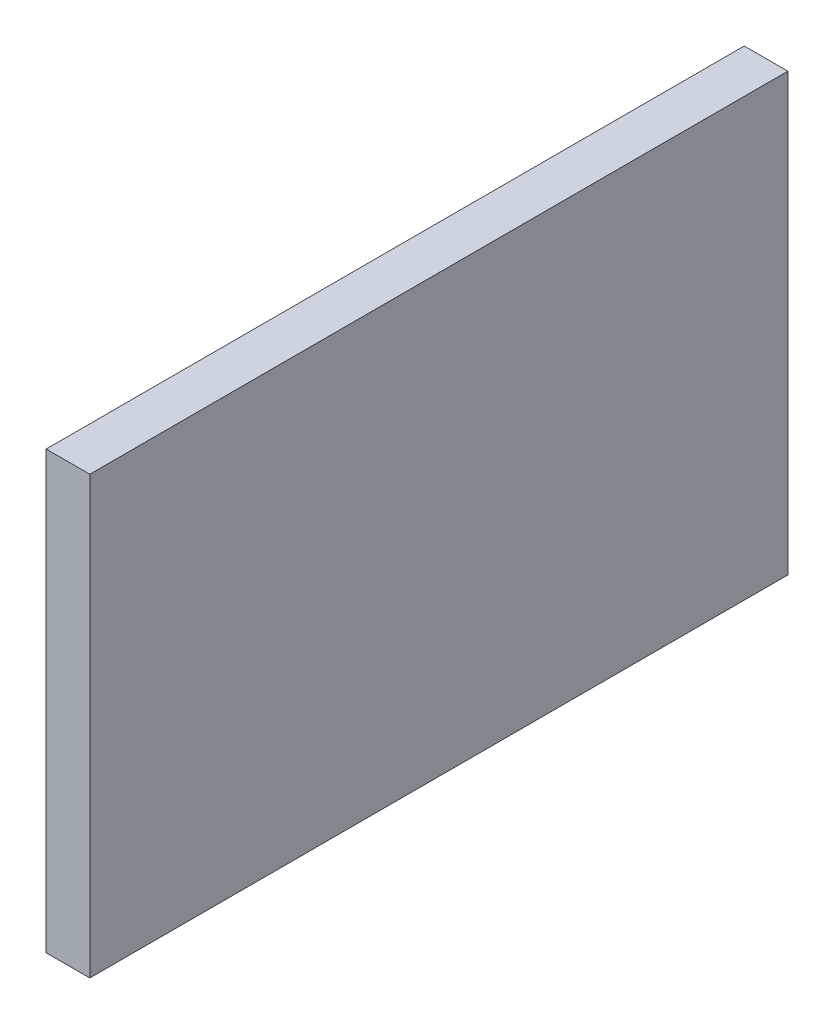
ISO-10303-21;
HEADER;
FILE_DESCRIPTION(('STEP AP214'),'2;1');
FILE_NAME('part.step','',(''),(''),'','','');
FILE_SCHEMA(('AUTOMOTIVE_DESIGN { 1 0 10303 214 1 1 1 1 }'));
ENDSEC;
DATA;
#1=APPLICATION_CONTEXT('core data for automotive mechanical design processes');
#2=APPLICATION_PROTOCOL_DEFINITION('international standard','automotive_design',2000,#1);
#3=PRODUCT_CONTEXT('',#1,'mechanical');
#4=PRODUCT('Part','Part','',(#3));
#5=PRODUCT_RELATED_PRODUCT_CATEGORY('part','',(#4));
#6=PRODUCT_DEFINITION_FORMATION('','',#4);
#7=PRODUCT_DEFINITION_CONTEXT('part definition',#1,'design');
#8=PRODUCT_DEFINITION('design','',#6,#7);
#9=PRODUCT_DEFINITION_SHAPE('','',#8);
#10=(LENGTH_UNIT() NAMED_UNIT(*) SI_UNIT(.MILLI.,.METRE.));
#11=(NAMED_UNIT(*) PLANE_ANGLE_UNIT() SI_UNIT($,.RADIAN.));
#12=(NAMED_UNIT(*) SI_UNIT($,.STERADIAN.) SOLID_ANGLE_UNIT());
#13=UNCERTAINTY_MEASURE_WITH_UNIT(LENGTH_MEASURE(1.E-05),#10,'distance_accuracy_value','');
#14=(GEOMETRIC_REPRESENTATION_CONTEXT(3) GLOBAL_UNCERTAINTY_ASSIGNED_CONTEXT((#13)) GLOBAL_UNIT_ASSIGNED_CONTEXT((#10,
#11,#12)) REPRESENTATION_CONTEXT('',''));
#15=CARTESIAN_POINT('',(0.,0.,0.));
#16=DIRECTION('',(0.,0.,1.));
#17=DIRECTION('',(1.,0.,0.));
#18=AXIS2_PLACEMENT_3D('',#15,#16,#17);
#19=CARTESIAN_POINT('',(3.175,-15.875,-25.4));
#20=DIRECTION('',(0.,0.,1.));
#21=DIRECTION('',(1.,0.,0.));
#22=AXIS2_PLACEMENT_3D('',#19,#20,#21);
#23=PLANE('',#22);
#24=DIRECTION('',(0.,1.,0.));
#25=VECTOR('',#24,1.);
#26=CARTESIAN_POINT('',(0.,-15.875,-25.4));
#27=LINE('',#26,#25);
#28=CARTESIAN_POINT('',(0.,-15.875,-25.4));
#29=VERTEX_POINT('',#28);
#30=CARTESIAN_POINT('',(0.,15.875,-25.4));
#31=VERTEX_POINT('',#30);
#32=EDGE_CURVE('E96',#29,#31,#27,.T.);
#33=ORIENTED_EDGE('',*,*,#32,.T.);
#34=DIRECTION('',(-1.,0.,0.));
#35=VECTOR('',#34,1.);
#36=CARTESIAN_POINT('',(3.175,15.875,-25.4));
#37=LINE('',#36,#35);
#38=CARTESIAN_POINT('',(3.175,15.875,-25.4));
#39=VERTEX_POINT('',#38);
#40=EDGE_CURVE('E11',#39,#31,#37,.T.);
#41=ORIENTED_EDGE('',*,*,#40,.F.);
#42=DIRECTION('',(0.,1.,0.));
#43=VECTOR('',#42,1.);
#44=CARTESIAN_POINT('',(3.175,-15.875,-25.4));
#45=LINE('',#44,#43);
#46=CARTESIAN_POINT('',(3.175,-15.875,-25.4));
#47=VERTEX_POINT('',#46);
#48=EDGE_CURVE('E84',#47,#39,#45,.T.);
#49=ORIENTED_EDGE('',*,*,#48,.F.);
#50=DIRECTION('',(-1.,0.,0.));
#51=VECTOR('',#50,1.);
#52=CARTESIAN_POINT('',(3.175,-15.875,-25.4));
#53=LINE('',#52,#51);
#54=EDGE_CURVE('E92',#47,#29,#53,.T.);
#55=ORIENTED_EDGE('',*,*,#54,.T.);
#56=EDGE_LOOP('',(#33,#41,#49,#55));
#57=FACE_BOUND('',#56,.T.);
#58=ADVANCED_FACE('F33',(#57),#23,.F.);
#59=CARTESIAN_POINT('',(3.175,15.875,25.4));
#60=DIRECTION('',(0.,-1.,0.));
#61=DIRECTION('',(0.,0.,-1.));
#62=AXIS2_PLACEMENT_3D('',#59,#60,#61);
#63=PLANE('',#62);
#64=DIRECTION('',(0.,0.,1.));
#65=VECTOR('',#64,1.);
#66=CARTESIAN_POINT('',(0.,15.875,25.4));
#67=LINE('',#66,#65);
#68=CARTESIAN_POINT('',(0.,15.875,25.4));
#69=VERTEX_POINT('',#68);
#70=EDGE_CURVE('E88',#31,#69,#67,.T.);
#71=ORIENTED_EDGE('',*,*,#70,.T.);
#72=DIRECTION('',(-1.,0.,0.));
#73=VECTOR('',#72,1.);
#74=CARTESIAN_POINT('',(3.175,15.875,25.4));
#75=LINE('',#74,#73);
#76=CARTESIAN_POINT('',(3.175,15.875,25.4));
#77=VERTEX_POINT('',#76);
#78=EDGE_CURVE('E41',#77,#69,#75,.T.);
#79=ORIENTED_EDGE('',*,*,#78,.F.);
#80=DIRECTION('',(0.,0.,1.));
#81=VECTOR('',#80,1.);
#82=CARTESIAN_POINT('',(3.175,15.875,25.4));
#83=LINE('',#82,#81);
#84=EDGE_CURVE('E79',#39,#77,#83,.T.);
#85=ORIENTED_EDGE('',*,*,#84,.F.);
#86=ORIENTED_EDGE('',*,*,#40,.T.);
#87=EDGE_LOOP('',(#71,#79,#85,#86));
#88=FACE_BOUND('',#87,.T.);
#89=ADVANCED_FACE('F87',(#88),#63,.F.);
#90=CARTESIAN_POINT('',(3.175,-15.875,25.4));
#91=DIRECTION('',(0.,0.,-1.));
#92=DIRECTION('',(-1.,0.,0.));
#93=AXIS2_PLACEMENT_3D('',#90,#91,#92);
#94=PLANE('',#93);
#95=DIRECTION('',(0.,-1.,0.));
#96=VECTOR('',#95,1.);
#97=CARTESIAN_POINT('',(0.,-15.875,25.4));
#98=LINE('',#97,#96);
#99=CARTESIAN_POINT('',(0.,-15.875,25.4));
#100=VERTEX_POINT('',#99);
#101=EDGE_CURVE('E66',#69,#100,#98,.T.);
#102=ORIENTED_EDGE('',*,*,#101,.T.);
#103=DIRECTION('',(-1.,0.,0.));
#104=VECTOR('',#103,1.);
#105=CARTESIAN_POINT('',(3.175,-15.875,25.4));
#106=LINE('',#105,#104);
#107=CARTESIAN_POINT('',(3.175,-15.875,25.4));
#108=VERTEX_POINT('',#107);
#109=EDGE_CURVE('E89',#108,#100,#106,.T.);
#110=ORIENTED_EDGE('',*,*,#109,.F.);
#111=DIRECTION('',(0.,-1.,0.));
#112=VECTOR('',#111,1.);
#113=CARTESIAN_POINT('',(3.175,-15.875,25.4));
#114=LINE('',#113,#112);
#115=EDGE_CURVE('E82',#77,#108,#114,.T.);
#116=ORIENTED_EDGE('',*,*,#115,.F.);
#117=ORIENTED_EDGE('',*,*,#78,.T.);
#118=EDGE_LOOP('',(#102,#110,#116,#117));
#119=FACE_BOUND('',#118,.T.);
#120=ADVANCED_FACE('F90',(#119),#94,.F.);
#121=CARTESIAN_POINT('',(3.175,-15.875,25.4));
#122=DIRECTION('',(0.,1.,0.));
#123=DIRECTION('',(0.,0.,1.));
#124=AXIS2_PLACEMENT_3D('',#121,#122,#123);
#125=PLANE('',#124);
#126=DIRECTION('',(0.,0.,-1.));
#127=VECTOR('',#126,1.);
#128=CARTESIAN_POINT('',(0.,-15.875,25.4));
#129=LINE('',#128,#127);
#130=EDGE_CURVE('E72',#100,#29,#129,.T.);
#131=ORIENTED_EDGE('',*,*,#130,.T.);
#132=ORIENTED_EDGE('',*,*,#54,.F.);
#133=DIRECTION('',(0.,0.,-1.));
#134=VECTOR('',#133,1.);
#135=CARTESIAN_POINT('',(3.175,-15.875,25.4));
#136=LINE('',#135,#134);
#137=EDGE_CURVE('E49',#108,#47,#136,.T.);
#138=ORIENTED_EDGE('',*,*,#137,.F.);
#139=ORIENTED_EDGE('',*,*,#109,.T.);
#140=EDGE_LOOP('',(#131,#132,#138,#139));
#141=FACE_BOUND('',#140,.T.);
#142=ADVANCED_FACE('F103',(#141),#125,.F.);
#143=CARTESIAN_POINT('',(3.175,15.875,-25.4));
#144=DIRECTION('',(-1.,0.,0.));
#145=DIRECTION('',(0.,0.,1.));
#146=AXIS2_PLACEMENT_3D('',#143,#144,#145);
#147=PLANE('',#146);
#148=ORIENTED_EDGE('',*,*,#48,.T.);
#149=ORIENTED_EDGE('',*,*,#84,.T.);
#150=ORIENTED_EDGE('',*,*,#115,.T.);
#151=ORIENTED_EDGE('',*,*,#137,.T.);
#152=EDGE_LOOP('',(#148,#149,#150,#151));
#153=FACE_BOUND('',#152,.T.);
#154=ADVANCED_FACE('F80',(#153),#147,.F.);
#155=CARTESIAN_POINT('',(0.,15.875,-25.4));
#156=DIRECTION('',(-1.,0.,0.));
#157=DIRECTION('',(0.,0.,1.));
#158=AXIS2_PLACEMENT_3D('',#155,#156,#157);
#159=PLANE('',#158);
#160=ORIENTED_EDGE('',*,*,#32,.F.);
#161=ORIENTED_EDGE('',*,*,#130,.F.);
#162=ORIENTED_EDGE('',*,*,#101,.F.);
#163=ORIENTED_EDGE('',*,*,#70,.F.);
#164=EDGE_LOOP('',(#160,#161,#162,#163));
#165=FACE_BOUND('',#164,.T.);
#166=ADVANCED_FACE('F106',(#165),#159,.T.);
#167=CLOSED_SHELL('',(#58,#89,#120,#142,#154,#166));
#168=MANIFOLD_SOLID_BREP('B2',#167);
#169=ADVANCED_BREP_SHAPE_REPRESENTATION('',(#18,#168),#14);
#170=SHAPE_DEFINITION_REPRESENTATION(#9,#169);
ENDSEC;
END-ISO-10303-21;
